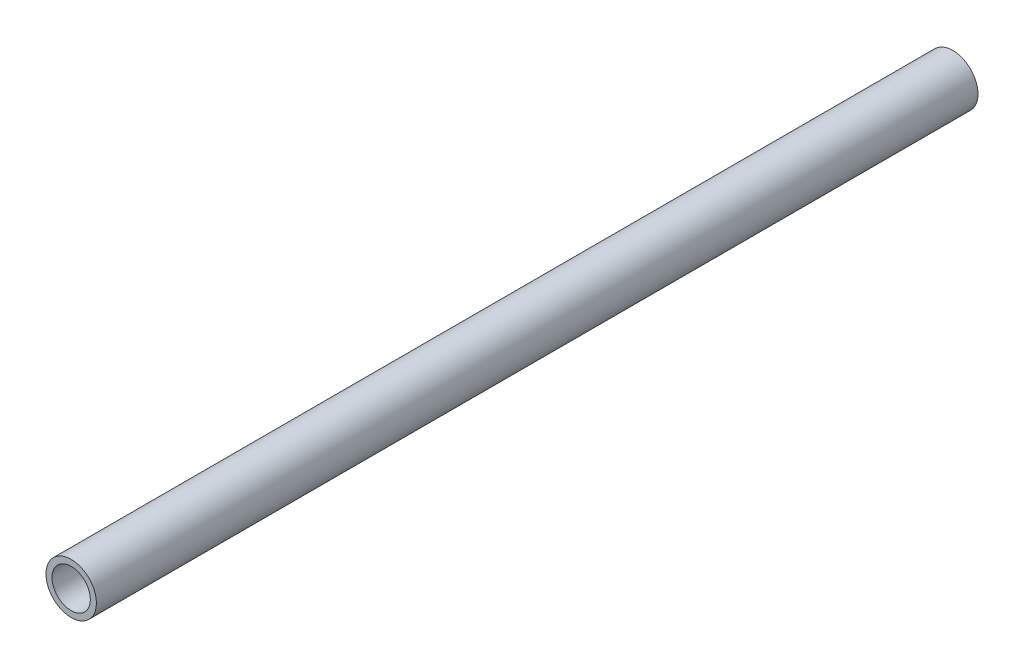
ISO-10303-21;
HEADER;
FILE_DESCRIPTION(('STEP AP214'),'2;1');
FILE_NAME('part.step','',(''),(''),'','','');
FILE_SCHEMA(('AUTOMOTIVE_DESIGN { 1 0 10303 214 1 1 1 1 }'));
ENDSEC;
DATA;
#1=APPLICATION_CONTEXT('core data for automotive mechanical design processes');
#2=APPLICATION_PROTOCOL_DEFINITION('international standard','automotive_design',2000,#1);
#3=PRODUCT_CONTEXT('',#1,'mechanical');
#4=PRODUCT('Part','Part','',(#3));
#5=PRODUCT_RELATED_PRODUCT_CATEGORY('part','',(#4));
#6=PRODUCT_DEFINITION_FORMATION('','',#4);
#7=PRODUCT_DEFINITION_CONTEXT('part definition',#1,'design');
#8=PRODUCT_DEFINITION('design','',#6,#7);
#9=PRODUCT_DEFINITION_SHAPE('','',#8);
#10=(LENGTH_UNIT() NAMED_UNIT(*) SI_UNIT(.MILLI.,.METRE.));
#11=(NAMED_UNIT(*) PLANE_ANGLE_UNIT() SI_UNIT($,.RADIAN.));
#12=(NAMED_UNIT(*) SI_UNIT($,.STERADIAN.) SOLID_ANGLE_UNIT());
#13=UNCERTAINTY_MEASURE_WITH_UNIT(LENGTH_MEASURE(1.E-05),#10,'distance_accuracy_value','');
#14=(GEOMETRIC_REPRESENTATION_CONTEXT(3) GLOBAL_UNCERTAINTY_ASSIGNED_CONTEXT((#13)) GLOBAL_UNIT_ASSIGNED_CONTEXT((#10,
#11,#12)) REPRESENTATION_CONTEXT('',''));
#15=CARTESIAN_POINT('',(0.,0.,0.));
#16=DIRECTION('',(0.,0.,1.));
#17=DIRECTION('',(1.,0.,0.));
#18=AXIS2_PLACEMENT_3D('',#15,#16,#17);
#19=CARTESIAN_POINT('',(0.,0.,-48.8513040782187));
#20=DIRECTION('',(0.,0.,1.));
#21=DIRECTION('',(1.,0.,0.));
#22=AXIS2_PLACEMENT_3D('',#19,#20,#21);
#23=CYLINDRICAL_SURFACE('',#22,8.35);
#24=CARTESIAN_POINT('',(0.,0.,-25.233937586588));
#25=DIRECTION('',(0.,0.,1.));
#26=DIRECTION('',(0.,-1.,0.));
#27=AXIS2_PLACEMENT_3D('',#24,#25,#26);
#28=CIRCLE('',#27,8.35);
#29=CARTESIAN_POINT('',(0.,-8.35,-25.233937586588));
#30=VERTEX_POINT('',#29);
#31=EDGE_CURVE('E39',#30,#30,#28,.F.);
#32=ORIENTED_EDGE('',*,*,#31,.F.);
#33=EDGE_LOOP('',(#32));
#34=FACE_BOUND('',#33,.T.);
#35=CARTESIAN_POINT('',(0.,0.,266.716847890713));
#36=DIRECTION('',(0.,0.,1.));
#37=DIRECTION('',(1.,0.,0.));
#38=AXIS2_PLACEMENT_3D('',#35,#36,#37);
#39=CIRCLE('',#38,8.35);
#40=CARTESIAN_POINT('',(8.35,0.,266.716847890713));
#41=VERTEX_POINT('',#40);
#42=EDGE_CURVE('E43',#41,#41,#39,.T.);
#43=ORIENTED_EDGE('',*,*,#42,.F.);
#44=EDGE_LOOP('',(#43));
#45=FACE_BOUND('',#44,.T.);
#46=ADVANCED_FACE('F33',(#34,#45),#23,.T.);
#47=CARTESIAN_POINT('',(0.,0.,-48.8513040782187));
#48=DIRECTION('',(0.,0.,1.));
#49=DIRECTION('',(1.,0.,0.));
#50=AXIS2_PLACEMENT_3D('',#47,#48,#49);
#51=CYLINDRICAL_SURFACE('',#50,6.35);
#52=CARTESIAN_POINT('',(0.,0.,-25.233937586588));
#53=DIRECTION('',(0.,0.,1.));
#54=DIRECTION('',(0.,-1.,0.));
#55=AXIS2_PLACEMENT_3D('',#52,#53,#54);
#56=CIRCLE('',#55,6.35);
#57=CARTESIAN_POINT('',(0.,-6.35,-25.233937586588));
#58=VERTEX_POINT('',#57);
#59=EDGE_CURVE('E10',#58,#58,#56,.F.);
#60=ORIENTED_EDGE('',*,*,#59,.T.);
#61=EDGE_LOOP('',(#60));
#62=FACE_BOUND('',#61,.T.);
#63=CARTESIAN_POINT('',(0.,0.,266.716847890713));
#64=DIRECTION('',(0.,0.,1.));
#65=DIRECTION('',(1.,0.,0.));
#66=AXIS2_PLACEMENT_3D('',#63,#64,#65);
#67=CIRCLE('',#66,6.35);
#68=CARTESIAN_POINT('',(6.35,0.,266.716847890713));
#69=VERTEX_POINT('',#68);
#70=EDGE_CURVE('E47',#69,#69,#67,.T.);
#71=ORIENTED_EDGE('',*,*,#70,.T.);
#72=EDGE_LOOP('',(#71));
#73=FACE_BOUND('',#72,.T.);
#74=ADVANCED_FACE('F53',(#62,#73),#51,.F.);
#75=CARTESIAN_POINT('',(3.31556855206103E-13,-6.60880907097305E-13,-25.233937586588));
#76=DIRECTION('',(0.,0.,1.));
#77=DIRECTION('',(0.991223374706321,-0.132197660477836,0.));
#78=AXIS2_PLACEMENT_3D('',#75,#76,#77);
#79=PLANE('',#78);
#80=ORIENTED_EDGE('',*,*,#31,.T.);
#81=EDGE_LOOP('',(#80));
#82=FACE_BOUND('',#81,.T.);
#83=ORIENTED_EDGE('',*,*,#59,.F.);
#84=EDGE_LOOP('',(#83));
#85=FACE_BOUND('',#84,.T.);
#86=ADVANCED_FACE('F57',(#82,#85),#79,.F.);
#87=CARTESIAN_POINT('',(0.,0.,266.716847890713));
#88=DIRECTION('',(0.,0.,1.));
#89=DIRECTION('',(1.,0.,0.));
#90=AXIS2_PLACEMENT_3D('',#87,#88,#89);
#91=PLANE('',#90);
#92=ORIENTED_EDGE('',*,*,#42,.T.);
#93=EDGE_LOOP('',(#92));
#94=FACE_BOUND('',#93,.T.);
#95=ORIENTED_EDGE('',*,*,#70,.F.);
#96=EDGE_LOOP('',(#95));
#97=FACE_BOUND('',#96,.T.);
#98=ADVANCED_FACE('F55',(#94,#97),#91,.T.);
#99=CLOSED_SHELL('',(#46,#74,#86,#98));
#100=MANIFOLD_SOLID_BREP('B2',#99);
#101=ADVANCED_BREP_SHAPE_REPRESENTATION('',(#18,#100),#14);
#102=SHAPE_DEFINITION_REPRESENTATION(#9,#101);
ENDSEC;
END-ISO-10303-21;
